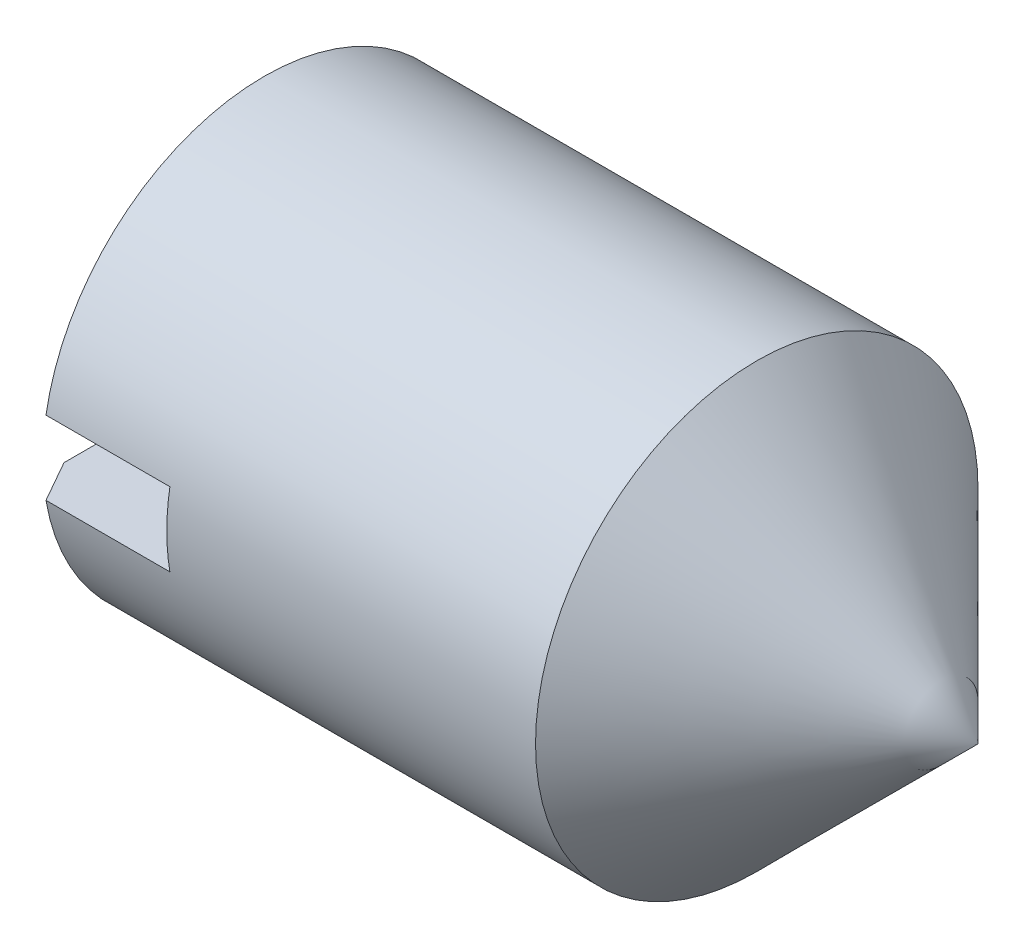
ISO-10303-21;
HEADER;
FILE_DESCRIPTION(('STEP AP214'),'2;1');
FILE_NAME('part.step','',(''),(''),'','','');
FILE_SCHEMA(('AUTOMOTIVE_DESIGN { 1 0 10303 214 1 1 1 1 }'));
ENDSEC;
DATA;
#1=APPLICATION_CONTEXT('core data for automotive mechanical design processes');
#2=APPLICATION_PROTOCOL_DEFINITION('international standard','automotive_design',2000,#1);
#3=PRODUCT_CONTEXT('',#1,'mechanical');
#4=PRODUCT('Part','Part','',(#3));
#5=PRODUCT_RELATED_PRODUCT_CATEGORY('part','',(#4));
#6=PRODUCT_DEFINITION_FORMATION('','',#4);
#7=PRODUCT_DEFINITION_CONTEXT('part definition',#1,'design');
#8=PRODUCT_DEFINITION('design','',#6,#7);
#9=PRODUCT_DEFINITION_SHAPE('','',#8);
#10=(LENGTH_UNIT() NAMED_UNIT(*) SI_UNIT(.MILLI.,.METRE.));
#11=(NAMED_UNIT(*) PLANE_ANGLE_UNIT() SI_UNIT($,.RADIAN.));
#12=(NAMED_UNIT(*) SI_UNIT($,.STERADIAN.) SOLID_ANGLE_UNIT());
#13=UNCERTAINTY_MEASURE_WITH_UNIT(LENGTH_MEASURE(1.E-05),#10,'distance_accuracy_value','');
#14=(GEOMETRIC_REPRESENTATION_CONTEXT(3) GLOBAL_UNCERTAINTY_ASSIGNED_CONTEXT((#13)) GLOBAL_UNIT_ASSIGNED_CONTEXT((#10,
#11,#12)) REPRESENTATION_CONTEXT('',''));
#15=CARTESIAN_POINT('',(0.,0.,0.));
#16=DIRECTION('',(0.,0.,1.));
#17=DIRECTION('',(1.,0.,0.));
#18=AXIS2_PLACEMENT_3D('',#15,#16,#17);
#19=CARTESIAN_POINT('',(0.,0.,0.));
#20=DIRECTION('',(-1.,0.,0.));
#21=DIRECTION('',(0.,0.,1.));
#22=AXIS2_PLACEMENT_3D('',#19,#20,#21);
#23=PLANE('',#22);
#24=CARTESIAN_POINT('',(0.,0.,0.));
#25=DIRECTION('',(-1.,0.,0.));
#26=DIRECTION('',(0.,0.,1.));
#27=AXIS2_PLACEMENT_3D('',#24,#25,#26);
#28=CIRCLE('',#27,2.4455);
#29=CARTESIAN_POINT('',(0.,-0.5,-2.39384006357985));
#30=VERTEX_POINT('',#29);
#31=CARTESIAN_POINT('',(0.,-0.5,2.39384006357985));
#32=VERTEX_POINT('',#31);
#33=EDGE_CURVE('E153',#30,#32,#28,.T.);
#34=ORIENTED_EDGE('',*,*,#33,.T.);
#35=DIRECTION('',(0.,0.,-1.));
#36=VECTOR('',#35,1.);
#37=CARTESIAN_POINT('',(0.,-0.5,3.));
#38=LINE('',#37,#36);
#39=EDGE_CURVE('E109',#32,#30,#38,.T.);
#40=ORIENTED_EDGE('',*,*,#39,.T.);
#41=EDGE_LOOP('',(#34,#40));
#42=FACE_BOUND('',#41,.T.);
#43=ADVANCED_FACE('F30',(#42),#23,.T.);
#44=CARTESIAN_POINT('',(0.,0.,0.));
#45=DIRECTION('',(1.,0.,0.));
#46=DIRECTION('',(0.,0.,-1.));
#47=AXIS2_PLACEMENT_3D('',#44,#45,#46);
#48=CONICAL_SURFACE('',#47,2.4455,1.0471975511966);
#49=CARTESIAN_POINT('',(0.320140724265646,0.,0.));
#50=DIRECTION('',(-1.,0.,0.));
#51=DIRECTION('',(0.,0.,1.));
#52=AXIS2_PLACEMENT_3D('',#49,#50,#51);
#53=CIRCLE('',#52,3.);
#54=CARTESIAN_POINT('',(0.320140724265646,-0.5,-2.95803989154981));
#55=VERTEX_POINT('',#54);
#56=CARTESIAN_POINT('',(0.320140724265646,-0.5,2.95803989154981));
#57=VERTEX_POINT('',#56);
#58=EDGE_CURVE('E158',#55,#57,#53,.T.);
#59=ORIENTED_EDGE('',*,*,#58,.T.);
#60=CARTESIAN_POINT('',(2.41258394382656,-0.499999999999999,6.60532086205164));
#61=CARTESIAN_POINT('',(2.25187146872936,-0.499999999999999,6.3261480087562));
#62=CARTESIAN_POINT('',(2.09119115854369,-0.499999999999999,6.04695658243323));
#63=CARTESIAN_POINT('',(1.76996293383332,-0.499999999999999,5.48849497052937));
#64=CARTESIAN_POINT('',(1.60941502024726,-0.499999999999999,5.20922478440862));
#65=CARTESIAN_POINT('',(1.28839359497671,-0.499999999999999,4.65034456384919));
#66=CARTESIAN_POINT('',(1.1279202454897,-0.5,4.37073443624067));
#67=CARTESIAN_POINT('',(0.807320184002182,-0.5,3.8113174623761));
#68=CARTESIAN_POINT('',(0.647193469988665,-0.5,3.53151061727501));
#69=CARTESIAN_POINT('',(0.408100897225837,-0.5,3.1125152777249));
#70=CARTESIAN_POINT('',(0.328873725062255,-0.5,2.97347593347573));
#71=CARTESIAN_POINT('',(0.170678980692584,-0.5,2.69524718081572));
#72=CARTESIAN_POINT('',(0.0917114117464856,-0.5,2.55605777054936));
#73=CARTESIAN_POINT('',(-0.0657753972271573,-0.5,2.27750518832083));
#74=CARTESIAN_POINT('',(-0.144294816816529,-0.5,2.13814211788068));
#75=CARTESIAN_POINT('',(-0.300633899834826,-0.5,1.85902858025974));
#76=CARTESIAN_POINT('',(-0.378453587231262,-0.5,1.71927812656391));
#77=CARTESIAN_POINT('',(-0.494364599933509,-0.5,1.50867749096039));
#78=CARTESIAN_POINT('',(-0.532973824441593,-0.5,1.43811267415717));
#79=CARTESIAN_POINT('',(-0.609663026554633,-0.5,1.29668750565438));
#80=CARTESIAN_POINT('',(-0.647742960774544,-0.5,1.22582713034008));
#81=CARTESIAN_POINT('',(-0.723108770739388,-0.5,1.08357795052142));
#82=CARTESIAN_POINT('',(-0.760393659069902,-0.5,1.01218862219859));
#83=CARTESIAN_POINT('',(-0.833557311757767,-0.5,0.86869805976317));
#84=CARTESIAN_POINT('',(-0.86943632586725,-0.5,0.796596954972318));
#85=CARTESIAN_POINT('',(-0.921735761079021,-0.5,0.686478414406012));
#86=CARTESIAN_POINT('',(-0.939137112693219,-0.5,0.648929731467024));
#87=CARTESIAN_POINT('',(-0.972904277266462,-0.5,0.573372036450574));
#88=CARTESIAN_POINT('',(-0.989270210408205,-0.5,0.535363078410404));
#89=CARTESIAN_POINT('',(-1.02046850021438,-0.5,0.458712296642447));
#90=CARTESIAN_POINT('',(-1.03530105805417,-0.5,0.420070556706767));
#91=CARTESIAN_POINT('',(-1.0626329026625,-0.5,0.341987411624675));
#92=CARTESIAN_POINT('',(-1.07513314037042,-0.5,0.302546339687606));
#93=CARTESIAN_POINT('',(-1.10054364527466,-0.5,0.207770777288873));
#94=CARTESIAN_POINT('',(-1.11188850181299,-0.5,0.151963993886033));
#95=CARTESIAN_POINT('',(-1.12104611104661,-0.5,0.0675855669808229));
#96=CARTESIAN_POINT('',(-1.12279575533825,-0.5,0.039442387918404));
#97=CARTESIAN_POINT('',(-1.12352722853315,-0.5,-0.0168816194762034));
#98=CARTESIAN_POINT('',(-1.12250911237566,-0.5,-0.0450624470499815));
#99=CARTESIAN_POINT('',(-1.11718499210842,-0.5,-0.108774022853232));
#100=CARTESIAN_POINT('',(-1.11206581165628,-0.5,-0.144235822962958));
#101=CARTESIAN_POINT('',(-1.09837916191916,-0.5,-0.214494441943479));
#102=CARTESIAN_POINT('',(-1.08980767170215,-0.5,-0.249290435669931));
#103=CARTESIAN_POINT('',(-1.07005473164046,-0.5,-0.318617944620513));
#104=CARTESIAN_POINT('',(-1.05883980085312,-0.5,-0.353139644424055));
#105=CARTESIAN_POINT('',(-1.03465513538755,-0.5,-0.421537597331869));
#106=CARTESIAN_POINT('',(-1.02168596810887,-0.5,-0.455414055111463));
#107=CARTESIAN_POINT('',(-0.993215905157254,-0.5,-0.525938067413515));
#108=CARTESIAN_POINT('',(-0.977591456942069,-0.5,-0.562535192397585));
#109=CARTESIAN_POINT('',(-0.94534351807274,-0.5,-0.635288828157524));
#110=CARTESIAN_POINT('',(-0.928719875202648,-0.5,-0.671445270786223));
#111=CARTESIAN_POINT('',(-0.877804857968184,-0.5,-0.779459927414697));
#112=CARTESIAN_POINT('',(-0.842483556310459,-0.5,-0.850830194189833));
#113=CARTESIAN_POINT('',(-0.770345911614345,-0.5,-0.992941844392936));
#114=CARTESIAN_POINT('',(-0.733527275365107,-0.5,-1.06368204412711));
#115=CARTESIAN_POINT('',(-0.659036386888727,-0.5,-1.20468422806986));
#116=CARTESIAN_POINT('',(-0.621364391188879,-0.5,-1.27494634794675));
#117=CARTESIAN_POINT('',(-0.545680756361515,-0.5,-1.41479535949314));
#118=CARTESIAN_POINT('',(-0.507672055764901,-0.5,-1.48438384788201));
#119=CARTESIAN_POINT('',(-0.431286897122454,-0.5,-1.62336539948794));
#120=CARTESIAN_POINT('',(-0.392910411325256,-0.5,-1.6927584474386));
#121=CARTESIAN_POINT('',(-0.27747881049701,-0.5,-1.90059207179381));
#122=CARTESIAN_POINT('',(-0.200047206301425,-0.5,-2.03882330690593));
#123=CARTESIAN_POINT('',(-0.0183272233024342,-0.5,-2.36176128168748));
#124=CARTESIAN_POINT('',(0.0861730241595693,-0.5,-2.54634848934753));
#125=CARTESIAN_POINT('',(0.295676121747799,-0.5,-2.91523985316434));
#126=CARTESIAN_POINT('',(0.400678977492447,-0.5,-3.0995440061264));
#127=CARTESIAN_POINT('',(0.716203684506086,-0.5,-3.6523637986134));
#128=CARTESIAN_POINT('',(0.927155150561119,-0.500000000000001,-4.02063407422451));
#129=CARTESIAN_POINT('',(1.35041993929872,-0.500000000000001,-4.75847179977855));
#130=CARTESIAN_POINT('',(1.56273524010537,-0.500000000000001,-5.12803811314498));
#131=CARTESIAN_POINT('',(1.98754812709208,-0.500000000000001,-5.86685105065448));
#132=CARTESIAN_POINT('',(2.20004559302386,-0.500000000000001,-6.23609774392564));
#133=CARTESIAN_POINT('',(2.41258394382656,-0.500000000000001,-6.60532086205165));
#134=B_SPLINE_CURVE_WITH_KNOTS('',3,(#60,#61,#62,#63,#64,#65,#66,#67,#68,#69,#70,#71,#72,#73,
#74,#75,#76,#77,#78,#79,#80,#81,#82,#83,#84,#85,#86,#87,#88,#89,#90,#91,#92,#93,#94,#95,#96,#97,
#98,#99,#100,#101,#102,#103,#104,#105,#106,#107,#108,#109,#110,#111,#112,#113,#114,#115,#116,
#117,#118,#119,#120,#121,#122,#123,#124,#125,#126,#127,#128,#129,#130,#131,#132,#133),
.UNSPECIFIED.,.F.,.F.,(4,2,2,2,2,2,2,2,2,2,2,2,2,2,2,2,2,2,2,2,2,2,2,2,2,2,2,2,2,2,2,2,2,2,2,2,
4),(0.,0.9663819060849,1.93277060554819,2.89993219807561,3.86708815891315,4.34717130016573,
4.82726044725141,5.30714141122872,5.78700587503051,6.02831479397468,6.26964337733049,
6.5112560192732,6.75282554255609,6.87696930888116,7.00109863910149,7.1252116631122,
7.24927397233963,7.41932120428445,7.50378692925795,7.58825097762336,7.6955100553695,
7.80289442153117,7.91171983981784,8.02051014283134,8.13986689493089,8.25924187598613,
8.49810024120929,8.73733932256767,8.97650741670208,9.21438210048225,9.45227487675975,
9.92759499098072,10.5639384478523,11.2002890347984,12.4735167300356,13.752154035042,
15.0302324227896),.UNSPECIFIED.);
#135=EDGE_CURVE('E100',#57,#32,#134,.T.);
#136=ORIENTED_EDGE('',*,*,#135,.T.);
#137=ORIENTED_EDGE('',*,*,#33,.F.);
#138=EDGE_CURVE('E163',#30,#55,#134,.T.);
#139=ORIENTED_EDGE('',*,*,#138,.T.);
#140=EDGE_LOOP('',(#59,#136,#137,#139));
#141=FACE_BOUND('',#140,.T.);
#142=ADVANCED_FACE('F138',(#141),#48,.T.);
#143=CARTESIAN_POINT('',(-12.7,0.,0.));
#144=DIRECTION('',(-1.,0.,0.));
#145=DIRECTION('',(0.,0.,1.));
#146=AXIS2_PLACEMENT_3D('',#143,#144,#145);
#147=CYLINDRICAL_SURFACE('',#146,3.);
#148=CARTESIAN_POINT('',(7.00000000000001,0.,0.));
#149=DIRECTION('',(-1.,0.,0.));
#150=DIRECTION('',(0.,0.,1.));
#151=AXIS2_PLACEMENT_3D('',#148,#149,#150);
#152=CIRCLE('',#151,3.);
#153=CARTESIAN_POINT('',(7.00000000000001,0.,3.));
#154=VERTEX_POINT('',#153);
#155=EDGE_CURVE('E162',#154,#154,#152,.T.);
#156=ORIENTED_EDGE('',*,*,#155,.T.);
#157=EDGE_LOOP('',(#156));
#158=FACE_BOUND('',#157,.T.);
#159=ORIENTED_EDGE('',*,*,#58,.F.);
#160=DIRECTION('',(-1.,0.,0.));
#161=VECTOR('',#160,1.);
#162=CARTESIAN_POINT('',(-12.7,-0.5,-2.95803989154981));
#163=LINE('',#162,#161);
#164=CARTESIAN_POINT('',(2.,-0.5,-2.95803989154981));
#165=VERTEX_POINT('',#164);
#166=EDGE_CURVE('E11',#55,#165,#163,.F.);
#167=ORIENTED_EDGE('',*,*,#166,.T.);
#168=CARTESIAN_POINT('',(2.,0.,0.));
#169=DIRECTION('',(-1.,0.,0.));
#170=DIRECTION('',(0.,0.,1.));
#171=AXIS2_PLACEMENT_3D('',#168,#169,#170);
#172=CIRCLE('',#171,3.);
#173=CARTESIAN_POINT('',(2.,0.5,-2.95803989154981));
#174=VERTEX_POINT('',#173);
#175=EDGE_CURVE('E96',#165,#174,#172,.F.);
#176=ORIENTED_EDGE('',*,*,#175,.T.);
#177=DIRECTION('',(-1.,0.,0.));
#178=VECTOR('',#177,1.);
#179=CARTESIAN_POINT('',(-12.7,0.5,-2.95803989154981));
#180=LINE('',#179,#178);
#181=CARTESIAN_POINT('',(0.320140724265646,0.5,-2.95803989154981));
#182=VERTEX_POINT('',#181);
#183=EDGE_CURVE('E38',#182,#174,#180,.F.);
#184=ORIENTED_EDGE('',*,*,#183,.F.);
#185=CARTESIAN_POINT('',(0.320140724265646,0.5,2.95803989154981));
#186=VERTEX_POINT('',#185);
#187=EDGE_CURVE('E154',#186,#182,#53,.T.);
#188=ORIENTED_EDGE('',*,*,#187,.F.);
#189=DIRECTION('',(-1.,0.,0.));
#190=VECTOR('',#189,1.);
#191=CARTESIAN_POINT('',(-12.7,0.5,2.95803989154981));
#192=LINE('',#191,#190);
#193=CARTESIAN_POINT('',(2.,0.5,2.95803989154981));
#194=VERTEX_POINT('',#193);
#195=EDGE_CURVE('E89',#194,#186,#192,.T.);
#196=ORIENTED_EDGE('',*,*,#195,.F.);
#197=CARTESIAN_POINT('',(2.,-0.5,2.95803989154981));
#198=VERTEX_POINT('',#197);
#199=EDGE_CURVE('E82',#194,#198,#172,.F.);
#200=ORIENTED_EDGE('',*,*,#199,.T.);
#201=DIRECTION('',(-1.,0.,0.));
#202=VECTOR('',#201,1.);
#203=CARTESIAN_POINT('',(-12.7,-0.5,2.95803989154981));
#204=LINE('',#203,#202);
#205=EDGE_CURVE('E86',#198,#57,#204,.T.);
#206=ORIENTED_EDGE('',*,*,#205,.T.);
#207=EDGE_LOOP('',(#159,#167,#176,#184,#188,#196,#200,#206));
#208=FACE_BOUND('',#207,.T.);
#209=ADVANCED_FACE('F85',(#158,#208),#147,.T.);
#210=DIRECTION('',(0.,0.,-1.));
#211=VECTOR('',#210,1.);
#212=CARTESIAN_POINT('',(0.,0.5,3.));
#213=LINE('',#212,#211);
#214=CARTESIAN_POINT('',(0.,0.5,2.39384006357985));
#215=VERTEX_POINT('',#214);
#216=CARTESIAN_POINT('',(0.,0.5,-2.39384006357985));
#217=VERTEX_POINT('',#216);
#218=EDGE_CURVE('E112',#215,#217,#213,.T.);
#219=ORIENTED_EDGE('',*,*,#218,.F.);
#220=EDGE_CURVE('E94',#215,#217,#28,.T.);
#221=ORIENTED_EDGE('',*,*,#220,.T.);
#222=EDGE_LOOP('',(#219,#221));
#223=FACE_BOUND('',#222,.T.);
#224=ADVANCED_FACE('F32',(#223),#23,.T.);
#225=CARTESIAN_POINT('',(2.41258394382656,0.500000000000001,6.60532086205164));
#226=CARTESIAN_POINT('',(2.25187146872936,0.500000000000001,6.3261480087562));
#227=CARTESIAN_POINT('',(2.09119115854369,0.500000000000001,6.04695658243323));
#228=CARTESIAN_POINT('',(1.76996293383332,0.500000000000001,5.48849497052937));
#229=CARTESIAN_POINT('',(1.60941502024727,0.5,5.20922478440862));
#230=CARTESIAN_POINT('',(1.28839359497671,0.5,4.65034456384919));
#231=CARTESIAN_POINT('',(1.12792024548971,0.5,4.37073443624068));
#232=CARTESIAN_POINT('',(0.807320184002184,0.5,3.81131746237611));
#233=CARTESIAN_POINT('',(0.647193469988667,0.5,3.53151061727501));
#234=CARTESIAN_POINT('',(0.408100897225838,0.5,3.11251527772491));
#235=CARTESIAN_POINT('',(0.328873725062256,0.5,2.97347593347573));
#236=CARTESIAN_POINT('',(0.170678980692585,0.5,2.69524718081573));
#237=CARTESIAN_POINT('',(0.0917114117464872,0.5,2.55605777054936));
#238=CARTESIAN_POINT('',(-0.0657753972271558,0.5,2.27750518832083));
#239=CARTESIAN_POINT('',(-0.144294816816528,0.5,2.13814211788068));
#240=CARTESIAN_POINT('',(-0.300633899834824,0.5,1.85902858025974));
#241=CARTESIAN_POINT('',(-0.37845358723126,0.5,1.71927812656391));
#242=CARTESIAN_POINT('',(-0.494364599933508,0.5,1.50867749096039));
#243=CARTESIAN_POINT('',(-0.532973824441592,0.5,1.43811267415717));
#244=CARTESIAN_POINT('',(-0.609663026554632,0.5,1.29668750565438));
#245=CARTESIAN_POINT('',(-0.647742960774543,0.5,1.22582713034008));
#246=CARTESIAN_POINT('',(-0.723108770739387,0.5,1.08357795052142));
#247=CARTESIAN_POINT('',(-0.760393659069901,0.5,1.01218862219859));
#248=CARTESIAN_POINT('',(-0.833557311757767,0.5,0.868698059763172));
#249=CARTESIAN_POINT('',(-0.86943632586725,0.5,0.796596954972319));
#250=CARTESIAN_POINT('',(-0.921735761079021,0.5,0.686478414406013));
#251=CARTESIAN_POINT('',(-0.939137112693218,0.5,0.648929731467025));
#252=CARTESIAN_POINT('',(-0.972904277266461,0.5,0.573372036450575));
#253=CARTESIAN_POINT('',(-0.989270210408204,0.5,0.535363078410405));
#254=CARTESIAN_POINT('',(-1.02046850021438,0.5,0.458712296642448));
#255=CARTESIAN_POINT('',(-1.03530105805417,0.5,0.420070556706768));
#256=CARTESIAN_POINT('',(-1.0626329026625,0.5,0.341987411624676));
#257=CARTESIAN_POINT('',(-1.07513314037042,0.5,0.302546339687606));
#258=CARTESIAN_POINT('',(-1.10054364527466,0.5,0.207770777288874));
#259=CARTESIAN_POINT('',(-1.11188850181299,0.5,0.151963993886034));
#260=CARTESIAN_POINT('',(-1.12104611104661,0.5,0.0675855669808244));
#261=CARTESIAN_POINT('',(-1.12279575533825,0.5,0.0394423879184055));
#262=CARTESIAN_POINT('',(-1.12352722853315,0.5,-0.0168816194762021));
#263=CARTESIAN_POINT('',(-1.12250911237566,0.5,-0.0450624470499806));
#264=CARTESIAN_POINT('',(-1.11718499210842,0.5,-0.108774022853232));
#265=CARTESIAN_POINT('',(-1.11206581165628,0.5,-0.144235822962958));
#266=CARTESIAN_POINT('',(-1.09837916191916,0.5,-0.214494441943478));
#267=CARTESIAN_POINT('',(-1.08980767170215,0.5,-0.249290435669931));
#268=CARTESIAN_POINT('',(-1.07005473164046,0.5,-0.318617944620512));
#269=CARTESIAN_POINT('',(-1.05883980085312,0.5,-0.353139644424054));
#270=CARTESIAN_POINT('',(-1.03465513538755,0.5,-0.421537597331868));
#271=CARTESIAN_POINT('',(-1.02168596810887,0.5,-0.455414055111462));
#272=CARTESIAN_POINT('',(-0.993215905157255,0.5,-0.525938067413514));
#273=CARTESIAN_POINT('',(-0.97759145694207,0.5,-0.562535192397582));
#274=CARTESIAN_POINT('',(-0.945343518072741,0.5,-0.635288828157521));
#275=CARTESIAN_POINT('',(-0.928719875202649,0.5,-0.67144527078622));
#276=CARTESIAN_POINT('',(-0.877804857968185,0.5,-0.779459927414694));
#277=CARTESIAN_POINT('',(-0.842483556310461,0.5,-0.85083019418983));
#278=CARTESIAN_POINT('',(-0.770345911614347,0.5,-0.992941844392932));
#279=CARTESIAN_POINT('',(-0.733527275365109,0.5,-1.0636820441271));
#280=CARTESIAN_POINT('',(-0.65903638688873,0.5,-1.20468422806985));
#281=CARTESIAN_POINT('',(-0.621364391188882,0.5,-1.27494634794675));
#282=CARTESIAN_POINT('',(-0.545680756361518,0.5,-1.41479535949314));
#283=CARTESIAN_POINT('',(-0.507672055764904,0.5,-1.48438384788201));
#284=CARTESIAN_POINT('',(-0.431286897122457,0.5,-1.62336539948794));
#285=CARTESIAN_POINT('',(-0.392910411325259,0.5,-1.6927584474386));
#286=CARTESIAN_POINT('',(-0.277478810497013,0.5,-1.9005920717938));
#287=CARTESIAN_POINT('',(-0.200047206301429,0.5,-2.03882330690592));
#288=CARTESIAN_POINT('',(-0.0183272233024382,0.5,-2.36176128168748));
#289=CARTESIAN_POINT('',(0.0861730241595652,0.5,-2.54634848934752));
#290=CARTESIAN_POINT('',(0.295676121747795,0.5,-2.91523985316433));
#291=CARTESIAN_POINT('',(0.400678977492444,0.5,-3.0995440061264));
#292=CARTESIAN_POINT('',(0.716203684506084,0.5,-3.65236379861339));
#293=CARTESIAN_POINT('',(0.927155150561116,0.499999999999999,-4.0206340742245));
#294=CARTESIAN_POINT('',(1.35041993929872,0.499999999999999,-4.75847179977855));
#295=CARTESIAN_POINT('',(1.56273524010536,0.499999999999999,-5.12803811314498));
#296=CARTESIAN_POINT('',(1.98754812709208,0.499999999999999,-5.86685105065448));
#297=CARTESIAN_POINT('',(2.20004559302386,0.499999999999999,-6.23609774392564));
#298=CARTESIAN_POINT('',(2.41258394382656,0.499999999999999,-6.60532086205164));
#299=B_SPLINE_CURVE_WITH_KNOTS('',3,(#225,#226,#227,#228,#229,#230,#231,#232,#233,#234,#235,
#236,#237,#238,#239,#240,#241,#242,#243,#244,#245,#246,#247,#248,#249,#250,#251,#252,#253,#254,
#255,#256,#257,#258,#259,#260,#261,#262,#263,#264,#265,#266,#267,#268,#269,#270,#271,#272,#273,
#274,#275,#276,#277,#278,#279,#280,#281,#282,#283,#284,#285,#286,#287,#288,#289,#290,#291,#292,
#293,#294,#295,#296,#297,#298),.UNSPECIFIED.,.F.,.F.,(4,2,2,2,2,2,2,2,2,2,2,2,2,2,2,2,2,2,2,2,2,
2,2,2,2,2,2,2,2,2,2,2,2,2,2,2,4),(0.,0.966381906084899,1.93277060554818,2.89993219807561,
3.86708815891314,4.34717130016573,4.82726044725141,5.30714141122872,5.78700587503051,
6.02831479397468,6.26964337733049,6.5112560192732,6.75282554255609,6.87696930888116,
7.00109863910149,7.1252116631122,7.24927397233963,7.41932120428445,7.50378692925795,
7.58825097762336,7.6955100553695,7.80289442153117,7.91171983981784,8.02051014283134,
8.13986689493088,8.25924187598613,8.49810024120929,8.73733932256767,8.97650741670208,
9.21438210048224,9.45227487675974,9.92759499098071,10.5639384478523,11.2002890347983,
12.4735167300356,13.752154035042,15.0302324227896),.UNSPECIFIED.);
#300=EDGE_CURVE('E104',#186,#215,#299,.T.);
#301=ORIENTED_EDGE('',*,*,#300,.F.);
#302=ORIENTED_EDGE('',*,*,#187,.T.);
#303=EDGE_CURVE('E107',#217,#182,#299,.T.);
#304=ORIENTED_EDGE('',*,*,#303,.F.);
#305=ORIENTED_EDGE('',*,*,#220,.F.);
#306=EDGE_LOOP('',(#301,#302,#304,#305));
#307=FACE_BOUND('',#306,.T.);
#308=ADVANCED_FACE('F125',(#307),#48,.T.);
#309=CARTESIAN_POINT('',(7.00000000000001,0.,0.));
#310=DIRECTION('',(-1.,0.,0.));
#311=DIRECTION('',(0.,0.,1.));
#312=AXIS2_PLACEMENT_3D('',#309,#310,#311);
#313=CONICAL_SURFACE('',#312,3.,0.78539816339745);
#314=CARTESIAN_POINT('',(10.,0.,0.));
#315=VERTEX_POINT('',#314);
#316=VERTEX_LOOP('',#315);
#317=FACE_BOUND('',#316,.T.);
#318=ORIENTED_EDGE('',*,*,#155,.F.);
#319=EDGE_LOOP('',(#318));
#320=FACE_BOUND('',#319,.T.);
#321=ADVANCED_FACE('F135',(#317,#320),#313,.T.);
#322=CARTESIAN_POINT('',(2.,-0.5,3.));
#323=DIRECTION('',(0.,1.,0.));
#324=DIRECTION('',(0.,0.,1.));
#325=AXIS2_PLACEMENT_3D('',#322,#323,#324);
#326=PLANE('',#325);
#327=ORIENTED_EDGE('',*,*,#39,.F.);
#328=ORIENTED_EDGE('',*,*,#135,.F.);
#329=ORIENTED_EDGE('',*,*,#205,.F.);
#330=DIRECTION('',(0.,0.,-1.));
#331=VECTOR('',#330,1.);
#332=CARTESIAN_POINT('',(2.,-0.5,3.));
#333=LINE('',#332,#331);
#334=EDGE_CURVE('E98',#198,#165,#333,.T.);
#335=ORIENTED_EDGE('',*,*,#334,.T.);
#336=ORIENTED_EDGE('',*,*,#166,.F.);
#337=ORIENTED_EDGE('',*,*,#138,.F.);
#338=EDGE_LOOP('',(#327,#328,#329,#335,#336,#337));
#339=FACE_BOUND('',#338,.T.);
#340=ADVANCED_FACE('F97',(#339),#326,.T.);
#341=CARTESIAN_POINT('',(2.,0.5,3.));
#342=DIRECTION('',(0.,1.,0.));
#343=DIRECTION('',(0.,0.,1.));
#344=AXIS2_PLACEMENT_3D('',#341,#342,#343);
#345=PLANE('',#344);
#346=ORIENTED_EDGE('',*,*,#303,.T.);
#347=ORIENTED_EDGE('',*,*,#183,.T.);
#348=DIRECTION('',(0.,0.,-1.));
#349=VECTOR('',#348,1.);
#350=CARTESIAN_POINT('',(2.,0.5,3.));
#351=LINE('',#350,#349);
#352=EDGE_CURVE('E105',#194,#174,#351,.T.);
#353=ORIENTED_EDGE('',*,*,#352,.F.);
#354=ORIENTED_EDGE('',*,*,#195,.T.);
#355=ORIENTED_EDGE('',*,*,#300,.T.);
#356=ORIENTED_EDGE('',*,*,#218,.T.);
#357=EDGE_LOOP('',(#346,#347,#353,#354,#355,#356));
#358=FACE_BOUND('',#357,.T.);
#359=ADVANCED_FACE('F128',(#358),#345,.F.);
#360=CARTESIAN_POINT('',(2.,0.5,3.));
#361=DIRECTION('',(-1.,0.,0.));
#362=DIRECTION('',(0.,0.,1.));
#363=AXIS2_PLACEMENT_3D('',#360,#361,#362);
#364=PLANE('',#363);
#365=ORIENTED_EDGE('',*,*,#334,.F.);
#366=ORIENTED_EDGE('',*,*,#199,.F.);
#367=ORIENTED_EDGE('',*,*,#352,.T.);
#368=ORIENTED_EDGE('',*,*,#175,.F.);
#369=EDGE_LOOP('',(#365,#366,#367,#368));
#370=FACE_BOUND('',#369,.T.);
#371=ADVANCED_FACE('F102',(#370),#364,.T.);
#372=CLOSED_SHELL('',(#43,#142,#209,#224,#308,#321,#340,#359,#371));
#373=MANIFOLD_SOLID_BREP('B2',#372);
#374=ADVANCED_BREP_SHAPE_REPRESENTATION('',(#18,#373),#14);
#375=SHAPE_DEFINITION_REPRESENTATION(#9,#374);
ENDSEC;
END-ISO-10303-21;
